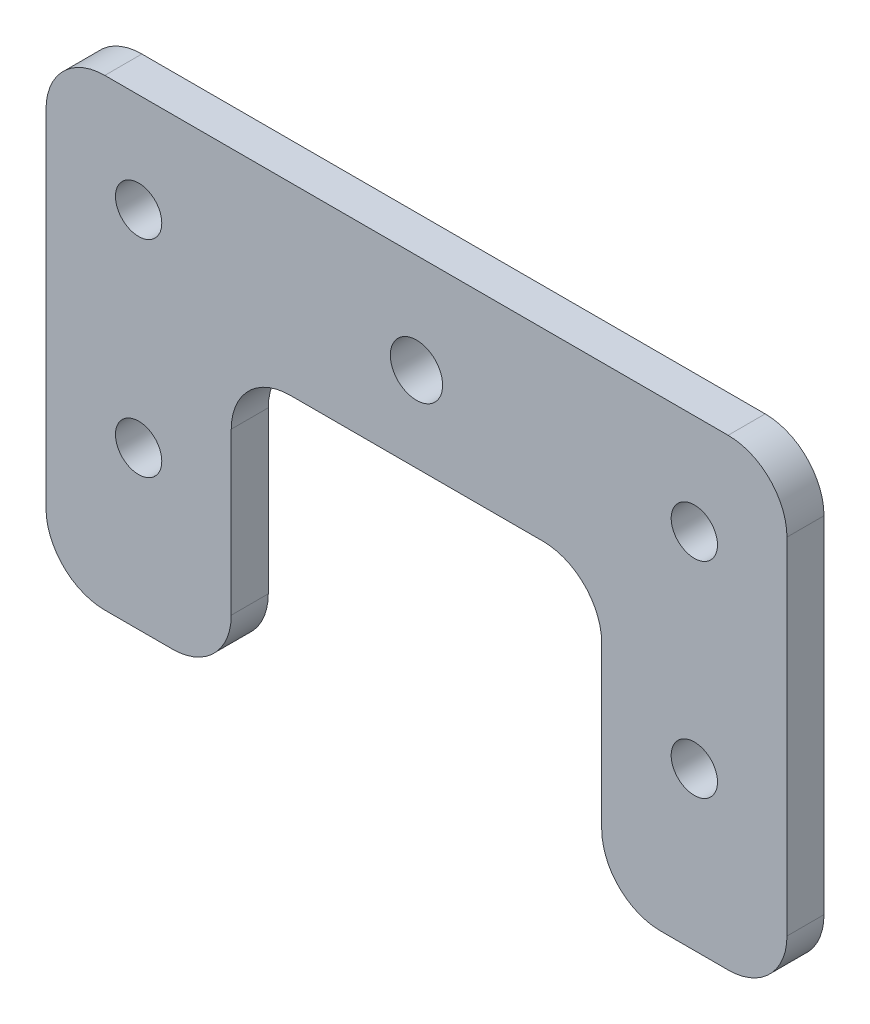
ISO-10303-21;
HEADER;
FILE_DESCRIPTION(('STEP AP214'),'2;1');
FILE_NAME('part.step','',(''),(''),'','','');
FILE_SCHEMA(('AUTOMOTIVE_DESIGN { 1 0 10303 214 1 1 1 1 }'));
ENDSEC;
DATA;
#1=APPLICATION_CONTEXT('core data for automotive mechanical design processes');
#2=APPLICATION_PROTOCOL_DEFINITION('international standard','automotive_design',2000,#1);
#3=PRODUCT_CONTEXT('',#1,'mechanical');
#4=PRODUCT('Part','Part','',(#3));
#5=PRODUCT_RELATED_PRODUCT_CATEGORY('part','',(#4));
#6=PRODUCT_DEFINITION_FORMATION('','',#4);
#7=PRODUCT_DEFINITION_CONTEXT('part definition',#1,'design');
#8=PRODUCT_DEFINITION('design','',#6,#7);
#9=PRODUCT_DEFINITION_SHAPE('','',#8);
#10=(LENGTH_UNIT() NAMED_UNIT(*) SI_UNIT(.MILLI.,.METRE.));
#11=(NAMED_UNIT(*) PLANE_ANGLE_UNIT() SI_UNIT($,.RADIAN.));
#12=(NAMED_UNIT(*) SI_UNIT($,.STERADIAN.) SOLID_ANGLE_UNIT());
#13=UNCERTAINTY_MEASURE_WITH_UNIT(LENGTH_MEASURE(1.E-05),#10,'distance_accuracy_value','');
#14=(GEOMETRIC_REPRESENTATION_CONTEXT(3) GLOBAL_UNCERTAINTY_ASSIGNED_CONTEXT((#13)) GLOBAL_UNIT_ASSIGNED_CONTEXT((#10,
#11,#12)) REPRESENTATION_CONTEXT('',''));
#15=CARTESIAN_POINT('',(0.,0.,0.));
#16=DIRECTION('',(0.,0.,1.));
#17=DIRECTION('',(1.,0.,0.));
#18=AXIS2_PLACEMENT_3D('',#15,#16,#17);
#19=CARTESIAN_POINT('',(0.,26.6043563241678,4.));
#20=DIRECTION('',(0.,1.,0.));
#21=DIRECTION('',(-1.,0.,0.));
#22=AXIS2_PLACEMENT_3D('',#19,#20,#21);
#23=PLANE('',#22);
#24=DIRECTION('',(1.,0.,0.));
#25=VECTOR('',#24,1.);
#26=CARTESIAN_POINT('',(0.,26.6043563241678,0.));
#27=LINE('',#26,#25);
#28=CARTESIAN_POINT('',(6.53805092256945,26.6043563241678,0.));
#29=VERTEX_POINT('',#28);
#30=CARTESIAN_POINT('',(73.8380509225694,26.6043563241678,0.));
#31=VERTEX_POINT('',#30);
#32=EDGE_CURVE('E213',#29,#31,#27,.T.);
#33=ORIENTED_EDGE('',*,*,#32,.F.);
#34=DIRECTION('',(0.,0.,-1.));
#35=VECTOR('',#34,1.);
#36=CARTESIAN_POINT('',(6.53805092256945,26.6043563241678,4.));
#37=LINE('',#36,#35);
#38=CARTESIAN_POINT('',(6.53805092256945,26.6043563241678,4.));
#39=VERTEX_POINT('',#38);
#40=EDGE_CURVE('E11',#39,#29,#37,.T.);
#41=ORIENTED_EDGE('',*,*,#40,.F.);
#42=DIRECTION('',(1.,0.,0.));
#43=VECTOR('',#42,1.);
#44=CARTESIAN_POINT('',(0.,26.6043563241678,4.));
#45=LINE('',#44,#43);
#46=CARTESIAN_POINT('',(73.8380509225694,26.6043563241678,4.));
#47=VERTEX_POINT('',#46);
#48=EDGE_CURVE('E348',#39,#47,#45,.T.);
#49=ORIENTED_EDGE('',*,*,#48,.T.);
#50=DIRECTION('',(0.,0.,-1.));
#51=VECTOR('',#50,1.);
#52=CARTESIAN_POINT('',(73.8380509225694,26.6043563241678,4.));
#53=LINE('',#52,#51);
#54=EDGE_CURVE('E120',#47,#31,#53,.T.);
#55=ORIENTED_EDGE('',*,*,#54,.T.);
#56=EDGE_LOOP('',(#33,#41,#49,#55));
#57=FACE_BOUND('',#56,.T.);
#58=ADVANCED_FACE('F44',(#57),#23,.T.);
#59=CARTESIAN_POINT('',(6.53805092256941,20.2543563241678,4.));
#60=DIRECTION('',(0.,0.,-1.));
#61=DIRECTION('',(-1.,0.,0.));
#62=AXIS2_PLACEMENT_3D('',#59,#60,#61);
#63=CYLINDRICAL_SURFACE('',#62,6.35);
#64=CARTESIAN_POINT('',(6.53805092256941,20.2543563241678,0.));
#65=DIRECTION('',(0.,0.,1.));
#66=DIRECTION('',(1.,0.,0.));
#67=AXIS2_PLACEMENT_3D('',#64,#65,#66);
#68=CIRCLE('',#67,6.35);
#69=CARTESIAN_POINT('',(0.188050922569407,20.2543563241677,0.));
#70=VERTEX_POINT('',#69);
#71=EDGE_CURVE('E217',#29,#70,#68,.T.);
#72=ORIENTED_EDGE('',*,*,#71,.T.);
#73=DIRECTION('',(0.,0.,-1.));
#74=VECTOR('',#73,1.);
#75=CARTESIAN_POINT('',(0.188050922569407,20.2543563241677,4.));
#76=LINE('',#75,#74);
#77=CARTESIAN_POINT('',(0.188050922569407,20.2543563241677,4.));
#78=VERTEX_POINT('',#77);
#79=EDGE_CURVE('E54',#78,#70,#76,.T.);
#80=ORIENTED_EDGE('',*,*,#79,.F.);
#81=CARTESIAN_POINT('',(6.53805092256941,20.2543563241678,4.));
#82=DIRECTION('',(0.,0.,1.));
#83=DIRECTION('',(1.,0.,0.));
#84=AXIS2_PLACEMENT_3D('',#81,#82,#83);
#85=CIRCLE('',#84,6.35);
#86=EDGE_CURVE('E341',#39,#78,#85,.T.);
#87=ORIENTED_EDGE('',*,*,#86,.F.);
#88=ORIENTED_EDGE('',*,*,#40,.T.);
#89=EDGE_LOOP('',(#72,#80,#87,#88));
#90=FACE_BOUND('',#89,.T.);
#91=ADVANCED_FACE('F328',(#90),#63,.T.);
#92=CARTESIAN_POINT('',(0.188050922569409,0.,4.));
#93=DIRECTION('',(-1.,0.,0.));
#94=DIRECTION('',(0.,-1.,0.));
#95=AXIS2_PLACEMENT_3D('',#92,#93,#94);
#96=PLANE('',#95);
#97=DIRECTION('',(0.,1.,0.));
#98=VECTOR('',#97,1.);
#99=CARTESIAN_POINT('',(0.188050922569409,0.,0.));
#100=LINE('',#99,#98);
#101=CARTESIAN_POINT('',(0.188050922569411,-17.0456436758322,0.));
#102=VERTEX_POINT('',#101);
#103=EDGE_CURVE('E221',#102,#70,#100,.T.);
#104=ORIENTED_EDGE('',*,*,#103,.F.);
#105=DIRECTION('',(0.,0.,-1.));
#106=VECTOR('',#105,1.);
#107=CARTESIAN_POINT('',(0.188050922569411,-17.0456436758322,4.));
#108=LINE('',#107,#106);
#109=CARTESIAN_POINT('',(0.188050922569411,-17.0456436758322,4.));
#110=VERTEX_POINT('',#109);
#111=EDGE_CURVE('E316',#110,#102,#108,.T.);
#112=ORIENTED_EDGE('',*,*,#111,.F.);
#113=DIRECTION('',(0.,1.,0.));
#114=VECTOR('',#113,1.);
#115=CARTESIAN_POINT('',(0.188050922569409,0.,4.));
#116=LINE('',#115,#114);
#117=EDGE_CURVE('E325',#110,#78,#116,.T.);
#118=ORIENTED_EDGE('',*,*,#117,.T.);
#119=ORIENTED_EDGE('',*,*,#79,.T.);
#120=EDGE_LOOP('',(#104,#112,#118,#119));
#121=FACE_BOUND('',#120,.T.);
#122=ADVANCED_FACE('F323',(#121),#96,.T.);
#123=CARTESIAN_POINT('',(6.53805092256941,-17.0456436758322,4.));
#124=DIRECTION('',(0.,0.,-1.));
#125=DIRECTION('',(-1.,0.,0.));
#126=AXIS2_PLACEMENT_3D('',#123,#124,#125);
#127=CYLINDRICAL_SURFACE('',#126,6.35);
#128=CARTESIAN_POINT('',(6.53805092256941,-17.0456436758322,0.));
#129=DIRECTION('',(0.,0.,1.));
#130=DIRECTION('',(1.,0.,0.));
#131=AXIS2_PLACEMENT_3D('',#128,#129,#130);
#132=CIRCLE('',#131,6.35);
#133=CARTESIAN_POINT('',(6.53805092256945,-23.3956436758322,0.));
#134=VERTEX_POINT('',#133);
#135=EDGE_CURVE('E225',#134,#102,#132,.F.);
#136=ORIENTED_EDGE('',*,*,#135,.F.);
#137=DIRECTION('',(0.,0.,-1.));
#138=VECTOR('',#137,1.);
#139=CARTESIAN_POINT('',(6.53805092256945,-23.3956436758322,4.));
#140=LINE('',#139,#138);
#141=CARTESIAN_POINT('',(6.53805092256945,-23.3956436758322,4.));
#142=VERTEX_POINT('',#141);
#143=EDGE_CURVE('E313',#142,#134,#140,.T.);
#144=ORIENTED_EDGE('',*,*,#143,.F.);
#145=CARTESIAN_POINT('',(6.53805092256941,-17.0456436758322,4.));
#146=DIRECTION('',(0.,0.,1.));
#147=DIRECTION('',(1.,0.,0.));
#148=AXIS2_PLACEMENT_3D('',#145,#146,#147);
#149=CIRCLE('',#148,6.35);
#150=EDGE_CURVE('E339',#142,#110,#149,.F.);
#151=ORIENTED_EDGE('',*,*,#150,.T.);
#152=ORIENTED_EDGE('',*,*,#111,.T.);
#153=EDGE_LOOP('',(#136,#144,#151,#152));
#154=FACE_BOUND('',#153,.T.);
#155=ADVANCED_FACE('F335',(#154),#127,.T.);
#156=CARTESIAN_POINT('',(0.,-23.3956436758322,4.));
#157=DIRECTION('',(0.,1.,0.));
#158=DIRECTION('',(-1.,0.,0.));
#159=AXIS2_PLACEMENT_3D('',#156,#157,#158);
#160=PLANE('',#159);
#161=DIRECTION('',(1.,0.,0.));
#162=VECTOR('',#161,1.);
#163=CARTESIAN_POINT('',(0.,-23.3956436758322,0.));
#164=LINE('',#163,#162);
#165=CARTESIAN_POINT('',(13.8380509225694,-23.3956436758322,0.));
#166=VERTEX_POINT('',#165);
#167=EDGE_CURVE('E229',#134,#166,#164,.T.);
#168=ORIENTED_EDGE('',*,*,#167,.T.);
#169=DIRECTION('',(0.,0.,-1.));
#170=VECTOR('',#169,1.);
#171=CARTESIAN_POINT('',(13.8380509225694,-23.3956436758322,4.));
#172=LINE('',#171,#170);
#173=CARTESIAN_POINT('',(13.8380509225694,-23.3956436758322,4.));
#174=VERTEX_POINT('',#173);
#175=EDGE_CURVE('E309',#174,#166,#172,.T.);
#176=ORIENTED_EDGE('',*,*,#175,.F.);
#177=DIRECTION('',(1.,0.,0.));
#178=VECTOR('',#177,1.);
#179=CARTESIAN_POINT('',(0.,-23.3956436758322,4.));
#180=LINE('',#179,#178);
#181=EDGE_CURVE('E346',#142,#174,#180,.T.);
#182=ORIENTED_EDGE('',*,*,#181,.F.);
#183=ORIENTED_EDGE('',*,*,#143,.T.);
#184=EDGE_LOOP('',(#168,#176,#182,#183));
#185=FACE_BOUND('',#184,.T.);
#186=ADVANCED_FACE('F483',(#185),#160,.F.);
#187=CARTESIAN_POINT('',(13.8380509225694,-17.0456436758322,4.));
#188=DIRECTION('',(0.,0.,-1.));
#189=DIRECTION('',(-1.,0.,0.));
#190=AXIS2_PLACEMENT_3D('',#187,#188,#189);
#191=CYLINDRICAL_SURFACE('',#190,6.35);
#192=CARTESIAN_POINT('',(13.8380509225694,-17.0456436758322,0.));
#193=DIRECTION('',(0.,0.,1.));
#194=DIRECTION('',(1.,0.,0.));
#195=AXIS2_PLACEMENT_3D('',#192,#193,#194);
#196=CIRCLE('',#195,6.35);
#197=CARTESIAN_POINT('',(20.1880509225694,-17.0456436758322,0.));
#198=VERTEX_POINT('',#197);
#199=EDGE_CURVE('E233',#166,#198,#196,.T.);
#200=ORIENTED_EDGE('',*,*,#199,.T.);
#201=DIRECTION('',(0.,0.,-1.));
#202=VECTOR('',#201,1.);
#203=CARTESIAN_POINT('',(20.1880509225694,-17.0456436758322,4.));
#204=LINE('',#203,#202);
#205=CARTESIAN_POINT('',(20.1880509225694,-17.0456436758322,4.));
#206=VERTEX_POINT('',#205);
#207=EDGE_CURVE('E306',#206,#198,#204,.T.);
#208=ORIENTED_EDGE('',*,*,#207,.F.);
#209=CARTESIAN_POINT('',(13.8380509225694,-17.0456436758322,4.));
#210=DIRECTION('',(0.,0.,1.));
#211=DIRECTION('',(1.,0.,0.));
#212=AXIS2_PLACEMENT_3D('',#209,#210,#211);
#213=CIRCLE('',#212,6.35);
#214=EDGE_CURVE('E354',#174,#206,#213,.T.);
#215=ORIENTED_EDGE('',*,*,#214,.F.);
#216=ORIENTED_EDGE('',*,*,#175,.T.);
#217=EDGE_LOOP('',(#200,#208,#215,#216));
#218=FACE_BOUND('',#217,.T.);
#219=ADVANCED_FACE('F479',(#218),#191,.T.);
#220=CARTESIAN_POINT('',(20.1880509225694,0.,4.));
#221=DIRECTION('',(1.,0.,0.));
#222=DIRECTION('',(0.,1.,0.));
#223=AXIS2_PLACEMENT_3D('',#220,#221,#222);
#224=PLANE('',#223);
#225=DIRECTION('',(0.,-1.,0.));
#226=VECTOR('',#225,1.);
#227=CARTESIAN_POINT('',(20.1880509225694,0.,0.));
#228=LINE('',#227,#226);
#229=CARTESIAN_POINT('',(20.1880509225694,0.349416953919576,0.));
#230=VERTEX_POINT('',#229);
#231=EDGE_CURVE('E237',#230,#198,#228,.T.);
#232=ORIENTED_EDGE('',*,*,#231,.F.);
#233=DIRECTION('',(0.,0.,-1.));
#234=VECTOR('',#233,1.);
#235=CARTESIAN_POINT('',(20.1880509225694,0.349416953919576,4.));
#236=LINE('',#235,#234);
#237=CARTESIAN_POINT('',(20.1880509225694,0.349416953919576,4.));
#238=VERTEX_POINT('',#237);
#239=EDGE_CURVE('E303',#238,#230,#236,.T.);
#240=ORIENTED_EDGE('',*,*,#239,.F.);
#241=DIRECTION('',(0.,-1.,0.));
#242=VECTOR('',#241,1.);
#243=CARTESIAN_POINT('',(20.1880509225694,0.,4.));
#244=LINE('',#243,#242);
#245=EDGE_CURVE('E357',#238,#206,#244,.T.);
#246=ORIENTED_EDGE('',*,*,#245,.T.);
#247=ORIENTED_EDGE('',*,*,#207,.T.);
#248=EDGE_LOOP('',(#232,#240,#246,#247));
#249=FACE_BOUND('',#248,.T.);
#250=ADVANCED_FACE('F475',(#249),#224,.T.);
#251=CARTESIAN_POINT('',(26.5380509225694,0.349416953919623,4.));
#252=DIRECTION('',(0.,0.,-1.));
#253=DIRECTION('',(-1.,0.,0.));
#254=AXIS2_PLACEMENT_3D('',#251,#252,#253);
#255=CYLINDRICAL_SURFACE('',#254,6.35);
#256=CARTESIAN_POINT('',(26.5380509225694,0.349416953919623,0.));
#257=DIRECTION('',(0.,0.,1.));
#258=DIRECTION('',(1.,0.,0.));
#259=AXIS2_PLACEMENT_3D('',#256,#257,#258);
#260=CIRCLE('',#259,6.35);
#261=CARTESIAN_POINT('',(26.5380509225695,6.69941695391962,0.));
#262=VERTEX_POINT('',#261);
#263=EDGE_CURVE('E241',#262,#230,#260,.T.);
#264=ORIENTED_EDGE('',*,*,#263,.F.);
#265=DIRECTION('',(0.,0.,-1.));
#266=VECTOR('',#265,1.);
#267=CARTESIAN_POINT('',(26.5380509225695,6.69941695391962,4.));
#268=LINE('',#267,#266);
#269=CARTESIAN_POINT('',(26.5380509225695,6.69941695391962,4.));
#270=VERTEX_POINT('',#269);
#271=EDGE_CURVE('E300',#270,#262,#268,.T.);
#272=ORIENTED_EDGE('',*,*,#271,.F.);
#273=CARTESIAN_POINT('',(26.5380509225694,0.349416953919623,4.));
#274=DIRECTION('',(0.,0.,1.));
#275=DIRECTION('',(1.,0.,0.));
#276=AXIS2_PLACEMENT_3D('',#273,#274,#275);
#277=CIRCLE('',#276,6.35);
#278=EDGE_CURVE('E361',#270,#238,#277,.T.);
#279=ORIENTED_EDGE('',*,*,#278,.T.);
#280=ORIENTED_EDGE('',*,*,#239,.T.);
#281=EDGE_LOOP('',(#264,#272,#279,#280));
#282=FACE_BOUND('',#281,.T.);
#283=ADVANCED_FACE('F471',(#282),#255,.F.);
#284=CARTESIAN_POINT('',(0.,6.69941695391962,4.));
#285=DIRECTION('',(0.,1.,0.));
#286=DIRECTION('',(-1.,0.,0.));
#287=AXIS2_PLACEMENT_3D('',#284,#285,#286);
#288=PLANE('',#287);
#289=DIRECTION('',(1.,0.,0.));
#290=VECTOR('',#289,1.);
#291=CARTESIAN_POINT('',(0.,6.69941695391962,0.));
#292=LINE('',#291,#290);
#293=CARTESIAN_POINT('',(53.8380509225694,6.69941695391962,0.));
#294=VERTEX_POINT('',#293);
#295=EDGE_CURVE('E245',#262,#294,#292,.T.);
#296=ORIENTED_EDGE('',*,*,#295,.T.);
#297=DIRECTION('',(0.,0.,-1.));
#298=VECTOR('',#297,1.);
#299=CARTESIAN_POINT('',(53.8380509225694,6.69941695391962,4.));
#300=LINE('',#299,#298);
#301=CARTESIAN_POINT('',(53.8380509225694,6.69941695391962,4.));
#302=VERTEX_POINT('',#301);
#303=EDGE_CURVE('E297',#302,#294,#300,.T.);
#304=ORIENTED_EDGE('',*,*,#303,.F.);
#305=DIRECTION('',(1.,0.,0.));
#306=VECTOR('',#305,1.);
#307=CARTESIAN_POINT('',(0.,6.69941695391962,4.));
#308=LINE('',#307,#306);
#309=EDGE_CURVE('E365',#270,#302,#308,.T.);
#310=ORIENTED_EDGE('',*,*,#309,.F.);
#311=ORIENTED_EDGE('',*,*,#271,.T.);
#312=EDGE_LOOP('',(#296,#304,#310,#311));
#313=FACE_BOUND('',#312,.T.);
#314=ADVANCED_FACE('F467',(#313),#288,.F.);
#315=CARTESIAN_POINT('',(53.8380509225694,0.349416953919623,4.));
#316=DIRECTION('',(0.,0.,-1.));
#317=DIRECTION('',(-1.,0.,0.));
#318=AXIS2_PLACEMENT_3D('',#315,#316,#317);
#319=CYLINDRICAL_SURFACE('',#318,6.35);
#320=CARTESIAN_POINT('',(53.8380509225694,0.349416953919623,0.));
#321=DIRECTION('',(0.,0.,1.));
#322=DIRECTION('',(1.,0.,0.));
#323=AXIS2_PLACEMENT_3D('',#320,#321,#322);
#324=CIRCLE('',#323,6.35);
#325=CARTESIAN_POINT('',(60.1880509225694,0.349416953919627,0.));
#326=VERTEX_POINT('',#325);
#327=EDGE_CURVE('E249',#326,#294,#324,.T.);
#328=ORIENTED_EDGE('',*,*,#327,.F.);
#329=DIRECTION('',(0.,0.,-1.));
#330=VECTOR('',#329,1.);
#331=CARTESIAN_POINT('',(60.1880509225694,0.349416953919627,4.));
#332=LINE('',#331,#330);
#333=CARTESIAN_POINT('',(60.1880509225694,0.349416953919627,4.));
#334=VERTEX_POINT('',#333);
#335=EDGE_CURVE('E294',#334,#326,#332,.T.);
#336=ORIENTED_EDGE('',*,*,#335,.F.);
#337=CARTESIAN_POINT('',(53.8380509225694,0.349416953919623,4.));
#338=DIRECTION('',(0.,0.,1.));
#339=DIRECTION('',(1.,0.,0.));
#340=AXIS2_PLACEMENT_3D('',#337,#338,#339);
#341=CIRCLE('',#340,6.35);
#342=EDGE_CURVE('E368',#334,#302,#341,.T.);
#343=ORIENTED_EDGE('',*,*,#342,.T.);
#344=ORIENTED_EDGE('',*,*,#303,.T.);
#345=EDGE_LOOP('',(#328,#336,#343,#344));
#346=FACE_BOUND('',#345,.T.);
#347=ADVANCED_FACE('F463',(#346),#319,.F.);
#348=CARTESIAN_POINT('',(60.1880509225694,0.,4.));
#349=DIRECTION('',(1.,0.,0.));
#350=DIRECTION('',(0.,1.,0.));
#351=AXIS2_PLACEMENT_3D('',#348,#349,#350);
#352=PLANE('',#351);
#353=DIRECTION('',(0.,-1.,0.));
#354=VECTOR('',#353,1.);
#355=CARTESIAN_POINT('',(60.1880509225694,0.,0.));
#356=LINE('',#355,#354);
#357=CARTESIAN_POINT('',(60.1880509225694,-17.0456436758322,0.));
#358=VERTEX_POINT('',#357);
#359=EDGE_CURVE('E253',#326,#358,#356,.T.);
#360=ORIENTED_EDGE('',*,*,#359,.T.);
#361=DIRECTION('',(0.,0.,-1.));
#362=VECTOR('',#361,1.);
#363=CARTESIAN_POINT('',(60.1880509225694,-17.0456436758322,4.));
#364=LINE('',#363,#362);
#365=CARTESIAN_POINT('',(60.1880509225694,-17.0456436758322,4.));
#366=VERTEX_POINT('',#365);
#367=EDGE_CURVE('E291',#366,#358,#364,.T.);
#368=ORIENTED_EDGE('',*,*,#367,.F.);
#369=DIRECTION('',(0.,-1.,0.));
#370=VECTOR('',#369,1.);
#371=CARTESIAN_POINT('',(60.1880509225694,0.,4.));
#372=LINE('',#371,#370);
#373=EDGE_CURVE('E372',#334,#366,#372,.T.);
#374=ORIENTED_EDGE('',*,*,#373,.F.);
#375=ORIENTED_EDGE('',*,*,#335,.T.);
#376=EDGE_LOOP('',(#360,#368,#374,#375));
#377=FACE_BOUND('',#376,.T.);
#378=ADVANCED_FACE('F459',(#377),#352,.F.);
#379=CARTESIAN_POINT('',(66.5380509225694,-17.0456436758322,4.));
#380=DIRECTION('',(0.,0.,-1.));
#381=DIRECTION('',(-1.,0.,0.));
#382=AXIS2_PLACEMENT_3D('',#379,#380,#381);
#383=CYLINDRICAL_SURFACE('',#382,6.35);
#384=CARTESIAN_POINT('',(66.5380509225694,-17.0456436758322,0.));
#385=DIRECTION('',(0.,0.,1.));
#386=DIRECTION('',(1.,0.,0.));
#387=AXIS2_PLACEMENT_3D('',#384,#385,#386);
#388=CIRCLE('',#387,6.35);
#389=CARTESIAN_POINT('',(66.5380509225694,-23.3956436758322,0.));
#390=VERTEX_POINT('',#389);
#391=EDGE_CURVE('E257',#390,#358,#388,.F.);
#392=ORIENTED_EDGE('',*,*,#391,.F.);
#393=DIRECTION('',(0.,0.,-1.));
#394=VECTOR('',#393,1.);
#395=CARTESIAN_POINT('',(66.5380509225694,-23.3956436758322,4.));
#396=LINE('',#395,#394);
#397=CARTESIAN_POINT('',(66.5380509225694,-23.3956436758322,4.));
#398=VERTEX_POINT('',#397);
#399=EDGE_CURVE('E288',#398,#390,#396,.T.);
#400=ORIENTED_EDGE('',*,*,#399,.F.);
#401=CARTESIAN_POINT('',(66.5380509225694,-17.0456436758322,4.));
#402=DIRECTION('',(0.,0.,1.));
#403=DIRECTION('',(1.,0.,0.));
#404=AXIS2_PLACEMENT_3D('',#401,#402,#403);
#405=CIRCLE('',#404,6.35);
#406=EDGE_CURVE('E375',#398,#366,#405,.F.);
#407=ORIENTED_EDGE('',*,*,#406,.T.);
#408=ORIENTED_EDGE('',*,*,#367,.T.);
#409=EDGE_LOOP('',(#392,#400,#407,#408));
#410=FACE_BOUND('',#409,.T.);
#411=ADVANCED_FACE('F456',(#410),#383,.T.);
#412=CARTESIAN_POINT('',(0.,-23.3956436758323,4.));
#413=DIRECTION('',(0.,-1.,0.));
#414=DIRECTION('',(1.,0.,0.));
#415=AXIS2_PLACEMENT_3D('',#412,#413,#414);
#416=PLANE('',#415);
#417=DIRECTION('',(-1.,0.,0.));
#418=VECTOR('',#417,1.);
#419=CARTESIAN_POINT('',(0.,-23.3956436758323,0.));
#420=LINE('',#419,#418);
#421=CARTESIAN_POINT('',(73.8380509225694,-23.3956436758322,0.));
#422=VERTEX_POINT('',#421);
#423=EDGE_CURVE('E261',#422,#390,#420,.T.);
#424=ORIENTED_EDGE('',*,*,#423,.F.);
#425=DIRECTION('',(0.,0.,-1.));
#426=VECTOR('',#425,1.);
#427=CARTESIAN_POINT('',(73.8380509225694,-23.3956436758322,4.));
#428=LINE('',#427,#426);
#429=CARTESIAN_POINT('',(73.8380509225694,-23.3956436758322,4.));
#430=VERTEX_POINT('',#429);
#431=EDGE_CURVE('E184',#430,#422,#428,.T.);
#432=ORIENTED_EDGE('',*,*,#431,.F.);
#433=DIRECTION('',(-1.,0.,0.));
#434=VECTOR('',#433,1.);
#435=CARTESIAN_POINT('',(0.,-23.3956436758323,4.));
#436=LINE('',#435,#434);
#437=EDGE_CURVE('E171',#430,#398,#436,.T.);
#438=ORIENTED_EDGE('',*,*,#437,.T.);
#439=ORIENTED_EDGE('',*,*,#399,.T.);
#440=EDGE_LOOP('',(#424,#432,#438,#439));
#441=FACE_BOUND('',#440,.T.);
#442=ADVANCED_FACE('F381',(#441),#416,.T.);
#443=CARTESIAN_POINT('',(73.8380509225694,-17.0456436758322,4.));
#444=DIRECTION('',(0.,0.,-1.));
#445=DIRECTION('',(-1.,0.,0.));
#446=AXIS2_PLACEMENT_3D('',#443,#444,#445);
#447=CYLINDRICAL_SURFACE('',#446,6.35);
#448=CARTESIAN_POINT('',(73.8380509225694,-17.0456436758322,0.));
#449=DIRECTION('',(0.,0.,1.));
#450=DIRECTION('',(1.,0.,0.));
#451=AXIS2_PLACEMENT_3D('',#448,#449,#450);
#452=CIRCLE('',#451,6.35);
#453=CARTESIAN_POINT('',(80.1880509225694,-17.0456436758322,0.));
#454=VERTEX_POINT('',#453);
#455=EDGE_CURVE('E179',#422,#454,#452,.T.);
#456=ORIENTED_EDGE('',*,*,#455,.T.);
#457=DIRECTION('',(0.,0.,-1.));
#458=VECTOR('',#457,1.);
#459=CARTESIAN_POINT('',(80.1880509225694,-17.0456436758322,4.));
#460=LINE('',#459,#458);
#461=CARTESIAN_POINT('',(80.1880509225694,-17.0456436758322,4.));
#462=VERTEX_POINT('',#461);
#463=EDGE_CURVE('E176',#462,#454,#460,.T.);
#464=ORIENTED_EDGE('',*,*,#463,.F.);
#465=CARTESIAN_POINT('',(73.8380509225694,-17.0456436758322,4.));
#466=DIRECTION('',(0.,0.,1.));
#467=DIRECTION('',(1.,0.,0.));
#468=AXIS2_PLACEMENT_3D('',#465,#466,#467);
#469=CIRCLE('',#468,6.35);
#470=EDGE_CURVE('E163',#430,#462,#469,.T.);
#471=ORIENTED_EDGE('',*,*,#470,.F.);
#472=ORIENTED_EDGE('',*,*,#431,.T.);
#473=EDGE_LOOP('',(#456,#464,#471,#472));
#474=FACE_BOUND('',#473,.T.);
#475=ADVANCED_FACE('F177',(#474),#447,.T.);
#476=CARTESIAN_POINT('',(80.1880509225694,0.,4.));
#477=DIRECTION('',(1.,0.,0.));
#478=DIRECTION('',(0.,0.,-1.));
#479=AXIS2_PLACEMENT_3D('',#476,#477,#478);
#480=PLANE('',#479);
#481=DIRECTION('',(0.,-1.,0.));
#482=VECTOR('',#481,1.);
#483=CARTESIAN_POINT('',(80.1880509225694,0.,0.));
#484=LINE('',#483,#482);
#485=CARTESIAN_POINT('',(80.1880509225694,20.2543563241678,0.));
#486=VERTEX_POINT('',#485);
#487=EDGE_CURVE('E267',#486,#454,#484,.T.);
#488=ORIENTED_EDGE('',*,*,#487,.F.);
#489=DIRECTION('',(0.,0.,-1.));
#490=VECTOR('',#489,1.);
#491=CARTESIAN_POINT('',(80.1880509225694,20.2543563241678,4.));
#492=LINE('',#491,#490);
#493=CARTESIAN_POINT('',(80.1880509225694,20.2543563241678,4.));
#494=VERTEX_POINT('',#493);
#495=EDGE_CURVE('E113',#494,#486,#492,.T.);
#496=ORIENTED_EDGE('',*,*,#495,.F.);
#497=DIRECTION('',(0.,-1.,0.));
#498=VECTOR('',#497,1.);
#499=CARTESIAN_POINT('',(80.1880509225694,0.,4.));
#500=LINE('',#499,#498);
#501=EDGE_CURVE('E168',#494,#462,#500,.T.);
#502=ORIENTED_EDGE('',*,*,#501,.T.);
#503=ORIENTED_EDGE('',*,*,#463,.T.);
#504=EDGE_LOOP('',(#488,#496,#502,#503));
#505=FACE_BOUND('',#504,.T.);
#506=ADVANCED_FACE('F186',(#505),#480,.T.);
#507=CARTESIAN_POINT('',(10.1880509225694,15.8664983327679,4.));
#508=DIRECTION('',(0.,0.,-1.));
#509=DIRECTION('',(-1.,0.,0.));
#510=AXIS2_PLACEMENT_3D('',#507,#508,#509);
#511=CYLINDRICAL_SURFACE('',#510,2.5);
#512=CARTESIAN_POINT('',(10.1880509225694,15.8664983327679,4.));
#513=DIRECTION('',(0.,0.,1.));
#514=DIRECTION('',(1.,0.,0.));
#515=AXIS2_PLACEMENT_3D('',#512,#513,#514);
#516=CIRCLE('',#515,2.5);
#517=CARTESIAN_POINT('',(12.6880509225694,15.8664983327679,4.));
#518=VERTEX_POINT('',#517);
#519=EDGE_CURVE('E190',#518,#518,#516,.T.);
#520=ORIENTED_EDGE('',*,*,#519,.T.);
#521=EDGE_LOOP('',(#520));
#522=FACE_BOUND('',#521,.T.);
#523=CARTESIAN_POINT('',(10.1880509225694,15.8664983327679,0.));
#524=DIRECTION('',(0.,0.,1.));
#525=DIRECTION('',(1.,0.,0.));
#526=AXIS2_PLACEMENT_3D('',#523,#524,#525);
#527=CIRCLE('',#526,2.5);
#528=CARTESIAN_POINT('',(12.6880509225694,15.8664983327679,0.));
#529=VERTEX_POINT('',#528);
#530=EDGE_CURVE('E273',#529,#529,#527,.T.);
#531=ORIENTED_EDGE('',*,*,#530,.F.);
#532=EDGE_LOOP('',(#531));
#533=FACE_BOUND('',#532,.T.);
#534=ADVANCED_FACE('F444',(#522,#533),#511,.F.);
#535=CARTESIAN_POINT('',(73.8380509225694,20.2543563241678,4.));
#536=DIRECTION('',(0.,0.,-1.));
#537=DIRECTION('',(-1.,0.,0.));
#538=AXIS2_PLACEMENT_3D('',#535,#536,#537);
#539=CYLINDRICAL_SURFACE('',#538,6.35);
#540=CARTESIAN_POINT('',(73.8380509225694,20.2543563241678,0.));
#541=DIRECTION('',(0.,0.,1.));
#542=DIRECTION('',(1.,0.,0.));
#543=AXIS2_PLACEMENT_3D('',#540,#541,#542);
#544=CIRCLE('',#543,6.35);
#545=EDGE_CURVE('E270',#486,#31,#544,.T.);
#546=ORIENTED_EDGE('',*,*,#545,.T.);
#547=ORIENTED_EDGE('',*,*,#54,.F.);
#548=CARTESIAN_POINT('',(73.8380509225694,20.2543563241678,4.));
#549=DIRECTION('',(0.,0.,1.));
#550=DIRECTION('',(1.,0.,0.));
#551=AXIS2_PLACEMENT_3D('',#548,#549,#550);
#552=CIRCLE('',#551,6.35);
#553=EDGE_CURVE('E62',#494,#47,#552,.T.);
#554=ORIENTED_EDGE('',*,*,#553,.F.);
#555=ORIENTED_EDGE('',*,*,#495,.T.);
#556=EDGE_LOOP('',(#546,#547,#554,#555));
#557=FACE_BOUND('',#556,.T.);
#558=ADVANCED_FACE('F383',(#557),#539,.T.);
#559=CARTESIAN_POINT('',(70.1880509225694,15.771437703016,4.));
#560=DIRECTION('',(0.,0.,-1.));
#561=DIRECTION('',(-1.,0.,0.));
#562=AXIS2_PLACEMENT_3D('',#559,#560,#561);
#563=CYLINDRICAL_SURFACE('',#562,2.50000000000001);
#564=CARTESIAN_POINT('',(70.1880509225694,15.771437703016,4.));
#565=DIRECTION('',(0.,0.,1.));
#566=DIRECTION('',(1.,0.,0.));
#567=AXIS2_PLACEMENT_3D('',#564,#565,#566);
#568=CIRCLE('',#567,2.50000000000001);
#569=CARTESIAN_POINT('',(72.6880509225694,15.771437703016,4.));
#570=VERTEX_POINT('',#569);
#571=EDGE_CURVE('E385',#570,#570,#568,.T.);
#572=ORIENTED_EDGE('',*,*,#571,.T.);
#573=EDGE_LOOP('',(#572));
#574=FACE_BOUND('',#573,.T.);
#575=CARTESIAN_POINT('',(70.1880509225694,15.771437703016,0.));
#576=DIRECTION('',(0.,0.,1.));
#577=DIRECTION('',(1.,0.,0.));
#578=AXIS2_PLACEMENT_3D('',#575,#576,#577);
#579=CIRCLE('',#578,2.50000000000001);
#580=CARTESIAN_POINT('',(72.6880509225694,15.771437703016,0.));
#581=VERTEX_POINT('',#580);
#582=EDGE_CURVE('E209',#581,#581,#579,.T.);
#583=ORIENTED_EDGE('',*,*,#582,.F.);
#584=EDGE_LOOP('',(#583));
#585=FACE_BOUND('',#584,.T.);
#586=ADVANCED_FACE('F408',(#574,#585),#563,.F.);
#587=CARTESIAN_POINT('',(70.1880509225694,-6.39564367583223,4.));
#588=DIRECTION('',(0.,0.,-1.));
#589=DIRECTION('',(-1.,0.,0.));
#590=AXIS2_PLACEMENT_3D('',#587,#588,#589);
#591=CYLINDRICAL_SURFACE('',#590,2.49999999999999);
#592=CARTESIAN_POINT('',(70.1880509225694,-6.39564367583223,4.));
#593=DIRECTION('',(0.,0.,1.));
#594=DIRECTION('',(1.,0.,0.));
#595=AXIS2_PLACEMENT_3D('',#592,#593,#594);
#596=CIRCLE('',#595,2.49999999999999);
#597=CARTESIAN_POINT('',(72.6880509225694,-6.39564367583223,4.));
#598=VERTEX_POINT('',#597);
#599=EDGE_CURVE('E388',#598,#598,#596,.F.);
#600=ORIENTED_EDGE('',*,*,#599,.F.);
#601=EDGE_LOOP('',(#600));
#602=FACE_BOUND('',#601,.T.);
#603=CARTESIAN_POINT('',(70.1880509225694,-6.39564367583223,0.));
#604=DIRECTION('',(0.,0.,1.));
#605=DIRECTION('',(1.,0.,0.));
#606=AXIS2_PLACEMENT_3D('',#603,#604,#605);
#607=CIRCLE('',#606,2.49999999999999);
#608=CARTESIAN_POINT('',(72.6880509225694,-6.39564367583223,0.));
#609=VERTEX_POINT('',#608);
#610=EDGE_CURVE('E205',#609,#609,#607,.F.);
#611=ORIENTED_EDGE('',*,*,#610,.T.);
#612=EDGE_LOOP('',(#611));
#613=FACE_BOUND('',#612,.T.);
#614=ADVANCED_FACE('F411',(#602,#613),#591,.F.);
#615=CARTESIAN_POINT('',(40.1880509225694,15.8664983327679,4.));
#616=DIRECTION('',(0.,0.,-1.));
#617=DIRECTION('',(-1.,0.,0.));
#618=AXIS2_PLACEMENT_3D('',#615,#616,#617);
#619=CYLINDRICAL_SURFACE('',#618,2.8213685039973);
#620=CARTESIAN_POINT('',(40.1880509225694,15.8664983327679,4.));
#621=DIRECTION('',(0.,0.,1.));
#622=DIRECTION('',(1.,0.,0.));
#623=AXIS2_PLACEMENT_3D('',#620,#621,#622);
#624=CIRCLE('',#623,2.8213685039973);
#625=CARTESIAN_POINT('',(43.0094194265667,15.8664983327679,4.));
#626=VERTEX_POINT('',#625);
#627=EDGE_CURVE('E281',#626,#626,#624,.T.);
#628=ORIENTED_EDGE('',*,*,#627,.T.);
#629=EDGE_LOOP('',(#628));
#630=FACE_BOUND('',#629,.T.);
#631=CARTESIAN_POINT('',(40.1880509225694,15.8664983327679,0.));
#632=DIRECTION('',(0.,0.,1.));
#633=DIRECTION('',(1.,0.,0.));
#634=AXIS2_PLACEMENT_3D('',#631,#632,#633);
#635=CIRCLE('',#634,2.8213685039973);
#636=CARTESIAN_POINT('',(43.0094194265667,15.8664983327679,0.));
#637=VERTEX_POINT('',#636);
#638=EDGE_CURVE('E201',#637,#637,#635,.T.);
#639=ORIENTED_EDGE('',*,*,#638,.F.);
#640=EDGE_LOOP('',(#639));
#641=FACE_BOUND('',#640,.T.);
#642=ADVANCED_FACE('F46',(#630,#641),#619,.F.);
#643=CARTESIAN_POINT('',(10.1880509225694,-6.39564367583224,4.));
#644=DIRECTION('',(0.,0.,-1.));
#645=DIRECTION('',(-1.,0.,0.));
#646=AXIS2_PLACEMENT_3D('',#643,#644,#645);
#647=CYLINDRICAL_SURFACE('',#646,2.5);
#648=CARTESIAN_POINT('',(10.1880509225694,-6.39564367583224,4.));
#649=DIRECTION('',(0.,0.,1.));
#650=DIRECTION('',(1.,0.,0.));
#651=AXIS2_PLACEMENT_3D('',#648,#649,#650);
#652=CIRCLE('',#651,2.5);
#653=CARTESIAN_POINT('',(12.6880509225694,-6.39564367583224,4.));
#654=VERTEX_POINT('',#653);
#655=EDGE_CURVE('E197',#654,#654,#652,.T.);
#656=ORIENTED_EDGE('',*,*,#655,.T.);
#657=EDGE_LOOP('',(#656));
#658=FACE_BOUND('',#657,.T.);
#659=CARTESIAN_POINT('',(10.1880509225694,-6.39564367583224,0.));
#660=DIRECTION('',(0.,0.,1.));
#661=DIRECTION('',(1.,0.,0.));
#662=AXIS2_PLACEMENT_3D('',#659,#660,#661);
#663=CIRCLE('',#662,2.5);
#664=CARTESIAN_POINT('',(12.6880509225694,-6.39564367583224,0.));
#665=VERTEX_POINT('',#664);
#666=EDGE_CURVE('E277',#665,#665,#663,.T.);
#667=ORIENTED_EDGE('',*,*,#666,.F.);
#668=EDGE_LOOP('',(#667));
#669=FACE_BOUND('',#668,.T.);
#670=ADVANCED_FACE('F402',(#658,#669),#647,.F.);
#671=CARTESIAN_POINT('',(0.,0.,4.));
#672=DIRECTION('',(0.,0.,1.));
#673=DIRECTION('',(1.,0.,0.));
#674=AXIS2_PLACEMENT_3D('',#671,#672,#673);
#675=PLANE('',#674);
#676=ORIENTED_EDGE('',*,*,#627,.F.);
#677=EDGE_LOOP('',(#676));
#678=FACE_BOUND('',#677,.T.);
#679=ORIENTED_EDGE('',*,*,#599,.T.);
#680=EDGE_LOOP('',(#679));
#681=FACE_BOUND('',#680,.T.);
#682=ORIENTED_EDGE('',*,*,#571,.F.);
#683=EDGE_LOOP('',(#682));
#684=FACE_BOUND('',#683,.T.);
#685=ORIENTED_EDGE('',*,*,#48,.F.);
#686=ORIENTED_EDGE('',*,*,#86,.T.);
#687=ORIENTED_EDGE('',*,*,#117,.F.);
#688=ORIENTED_EDGE('',*,*,#150,.F.);
#689=ORIENTED_EDGE('',*,*,#181,.T.);
#690=ORIENTED_EDGE('',*,*,#214,.T.);
#691=ORIENTED_EDGE('',*,*,#245,.F.);
#692=ORIENTED_EDGE('',*,*,#278,.F.);
#693=ORIENTED_EDGE('',*,*,#309,.T.);
#694=ORIENTED_EDGE('',*,*,#342,.F.);
#695=ORIENTED_EDGE('',*,*,#373,.T.);
#696=ORIENTED_EDGE('',*,*,#406,.F.);
#697=ORIENTED_EDGE('',*,*,#437,.F.);
#698=ORIENTED_EDGE('',*,*,#470,.T.);
#699=ORIENTED_EDGE('',*,*,#501,.F.);
#700=ORIENTED_EDGE('',*,*,#553,.T.);
#701=EDGE_LOOP('',(#685,#686,#687,#688,#689,#690,#691,#692,#693,#694,#695,#696,#697,#698,#699,#700));
#702=FACE_BOUND('',#701,.T.);
#703=ORIENTED_EDGE('',*,*,#519,.F.);
#704=EDGE_LOOP('',(#703));
#705=FACE_BOUND('',#704,.T.);
#706=ORIENTED_EDGE('',*,*,#655,.F.);
#707=EDGE_LOOP('',(#706));
#708=FACE_BOUND('',#707,.T.);
#709=ADVANCED_FACE('F165',(#678,#681,#684,#702,#705,#708),#675,.T.);
#710=CARTESIAN_POINT('',(0.,0.,0.));
#711=DIRECTION('',(0.,0.,1.));
#712=DIRECTION('',(1.,0.,0.));
#713=AXIS2_PLACEMENT_3D('',#710,#711,#712);
#714=PLANE('',#713);
#715=ORIENTED_EDGE('',*,*,#638,.T.);
#716=EDGE_LOOP('',(#715));
#717=FACE_BOUND('',#716,.T.);
#718=ORIENTED_EDGE('',*,*,#610,.F.);
#719=EDGE_LOOP('',(#718));
#720=FACE_BOUND('',#719,.T.);
#721=ORIENTED_EDGE('',*,*,#582,.T.);
#722=EDGE_LOOP('',(#721));
#723=FACE_BOUND('',#722,.T.);
#724=ORIENTED_EDGE('',*,*,#32,.T.);
#725=ORIENTED_EDGE('',*,*,#545,.F.);
#726=ORIENTED_EDGE('',*,*,#487,.T.);
#727=ORIENTED_EDGE('',*,*,#455,.F.);
#728=ORIENTED_EDGE('',*,*,#423,.T.);
#729=ORIENTED_EDGE('',*,*,#391,.T.);
#730=ORIENTED_EDGE('',*,*,#359,.F.);
#731=ORIENTED_EDGE('',*,*,#327,.T.);
#732=ORIENTED_EDGE('',*,*,#295,.F.);
#733=ORIENTED_EDGE('',*,*,#263,.T.);
#734=ORIENTED_EDGE('',*,*,#231,.T.);
#735=ORIENTED_EDGE('',*,*,#199,.F.);
#736=ORIENTED_EDGE('',*,*,#167,.F.);
#737=ORIENTED_EDGE('',*,*,#135,.T.);
#738=ORIENTED_EDGE('',*,*,#103,.T.);
#739=ORIENTED_EDGE('',*,*,#71,.F.);
#740=EDGE_LOOP('',(#724,#725,#726,#727,#728,#729,#730,#731,#732,#733,#734,#735,#736,#737,#738,#739));
#741=FACE_BOUND('',#740,.T.);
#742=ORIENTED_EDGE('',*,*,#530,.T.);
#743=EDGE_LOOP('',(#742));
#744=FACE_BOUND('',#743,.T.);
#745=ORIENTED_EDGE('',*,*,#666,.T.);
#746=EDGE_LOOP('',(#745));
#747=FACE_BOUND('',#746,.T.);
#748=ADVANCED_FACE('F330',(#717,#720,#723,#741,#744,#747),#714,.F.);
#749=CLOSED_SHELL('',(#58,#91,#122,#155,#186,#219,#250,#283,#314,#347,#378,#411,#442,#475,#506,
#534,#558,#586,#614,#642,#670,#709,#748));
#750=MANIFOLD_SOLID_BREP('B2',#749);
#751=ADVANCED_BREP_SHAPE_REPRESENTATION('',(#18,#750),#14);
#752=SHAPE_DEFINITION_REPRESENTATION(#9,#751);
ENDSEC;
END-ISO-10303-21;
